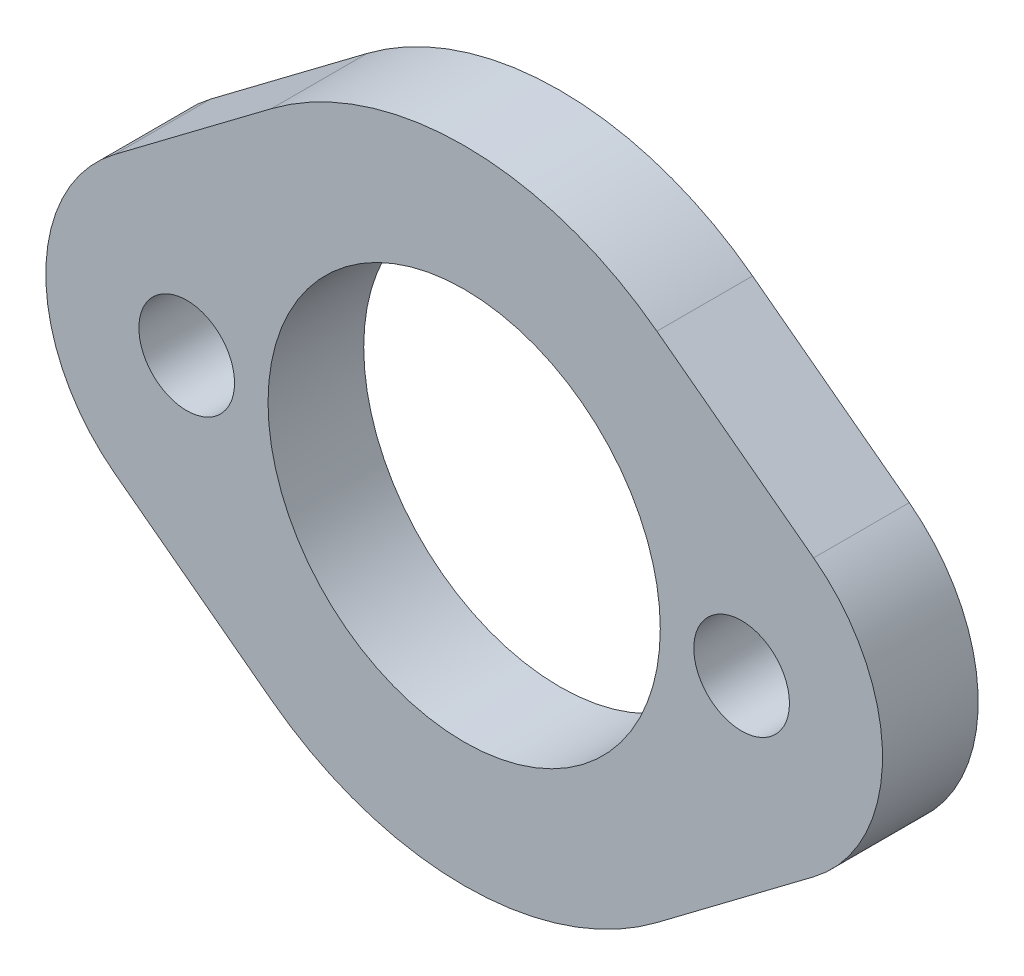
ISO-10303-21;
HEADER;
FILE_DESCRIPTION(('STEP AP214'),'2;1');
FILE_NAME('part.step','',(''),(''),'','','');
FILE_SCHEMA(('AUTOMOTIVE_DESIGN { 1 0 10303 214 1 1 1 1 }'));
ENDSEC;
DATA;
#1=APPLICATION_CONTEXT('core data for automotive mechanical design processes');
#2=APPLICATION_PROTOCOL_DEFINITION('international standard','automotive_design',2000,#1);
#3=PRODUCT_CONTEXT('',#1,'mechanical');
#4=PRODUCT('Part','Part','',(#3));
#5=PRODUCT_RELATED_PRODUCT_CATEGORY('part','',(#4));
#6=PRODUCT_DEFINITION_FORMATION('','',#4);
#7=PRODUCT_DEFINITION_CONTEXT('part definition',#1,'design');
#8=PRODUCT_DEFINITION('design','',#6,#7);
#9=PRODUCT_DEFINITION_SHAPE('','',#8);
#10=(LENGTH_UNIT() NAMED_UNIT(*) SI_UNIT(.MILLI.,.METRE.));
#11=(NAMED_UNIT(*) PLANE_ANGLE_UNIT() SI_UNIT($,.RADIAN.));
#12=(NAMED_UNIT(*) SI_UNIT($,.STERADIAN.) SOLID_ANGLE_UNIT());
#13=UNCERTAINTY_MEASURE_WITH_UNIT(LENGTH_MEASURE(1.E-05),#10,'distance_accuracy_value','');
#14=(GEOMETRIC_REPRESENTATION_CONTEXT(3) GLOBAL_UNCERTAINTY_ASSIGNED_CONTEXT((#13)) GLOBAL_UNIT_ASSIGNED_CONTEXT((#10,
#11,#12)) REPRESENTATION_CONTEXT('',''));
#15=CARTESIAN_POINT('',(0.,0.,0.));
#16=DIRECTION('',(0.,0.,1.));
#17=DIRECTION('',(1.,0.,0.));
#18=AXIS2_PLACEMENT_3D('',#15,#16,#17);
#19=CARTESIAN_POINT('',(-12.8297842923434,0.,5.));
#20=DIRECTION('',(0.,0.,1.));
#21=DIRECTION('',(1.,0.,0.));
#22=AXIS2_PLACEMENT_3D('',#19,#20,#21);
#23=PLANE('',#22);
#24=CARTESIAN_POINT('',(-14.5,0.,5.));
#25=DIRECTION('',(0.,0.,1.));
#26=DIRECTION('',(1.,0.,0.));
#27=AXIS2_PLACEMENT_3D('',#24,#25,#26);
#28=CIRCLE('',#27,2.5);
#29=CARTESIAN_POINT('',(-12.,0.,5.));
#30=VERTEX_POINT('',#29);
#31=EDGE_CURVE('E193',#30,#30,#28,.T.);
#32=ORIENTED_EDGE('',*,*,#31,.F.);
#33=EDGE_LOOP('',(#32));
#34=FACE_BOUND('',#33,.T.);
#35=CARTESIAN_POINT('',(-12.8297842923434,0.,5.));
#36=DIRECTION('',(0.,0.,1.));
#37=DIRECTION('',(1.,0.,0.));
#38=AXIS2_PLACEMENT_3D('',#35,#36,#37);
#39=CIRCLE('',#38,9.03409373618479);
#40=CARTESIAN_POINT('',(-18.2629403656315,7.21773265766097,5.));
#41=VERTEX_POINT('',#40);
#42=CARTESIAN_POINT('',(-18.2629403656315,-7.21773265766097,5.));
#43=VERTEX_POINT('',#42);
#44=EDGE_CURVE('E156',#41,#43,#39,.T.);
#45=ORIENTED_EDGE('',*,*,#44,.T.);
#46=DIRECTION('',(0.798943742276147,-0.601405767080584,0.));
#47=VECTOR('',#46,1.);
#48=CARTESIAN_POINT('',(-18.2629403656315,-7.21773265766097,5.));
#49=LINE('',#48,#47);
#50=CARTESIAN_POINT('',(-10.0735465985998,-13.3823076831255,5.));
#51=VERTEX_POINT('',#50);
#52=EDGE_CURVE('E104',#43,#51,#49,.T.);
#53=ORIENTED_EDGE('',*,*,#52,.T.);
#54=CARTESIAN_POINT('',(0.,0.,5.));
#55=DIRECTION('',(0.,0.,1.));
#56=DIRECTION('',(1.,0.,0.));
#57=AXIS2_PLACEMENT_3D('',#54,#55,#56);
#58=CIRCLE('',#57,16.75);
#59=CARTESIAN_POINT('',(10.0735465985998,-13.3823076831255,5.));
#60=VERTEX_POINT('',#59);
#61=EDGE_CURVE('E171',#51,#60,#58,.T.);
#62=ORIENTED_EDGE('',*,*,#61,.T.);
#63=DIRECTION('',(0.798943742276147,0.601405767080584,0.));
#64=VECTOR('',#63,1.);
#65=CARTESIAN_POINT('',(10.0735465985998,-13.3823076831255,5.));
#66=LINE('',#65,#64);
#67=CARTESIAN_POINT('',(18.2629403656315,-7.21773265766097,5.));
#68=VERTEX_POINT('',#67);
#69=EDGE_CURVE('E184',#60,#68,#66,.T.);
#70=ORIENTED_EDGE('',*,*,#69,.T.);
#71=CARTESIAN_POINT('',(12.8297842923434,0.,5.));
#72=DIRECTION('',(0.,0.,1.));
#73=DIRECTION('',(1.,0.,0.));
#74=AXIS2_PLACEMENT_3D('',#71,#72,#73);
#75=CIRCLE('',#74,9.03409373618479);
#76=CARTESIAN_POINT('',(18.2629403656315,7.21773265766097,5.));
#77=VERTEX_POINT('',#76);
#78=EDGE_CURVE('E123',#68,#77,#75,.T.);
#79=ORIENTED_EDGE('',*,*,#78,.T.);
#80=DIRECTION('',(-0.798943742276147,0.601405767080584,0.));
#81=VECTOR('',#80,1.);
#82=CARTESIAN_POINT('',(18.2629403656315,7.21773265766097,5.));
#83=LINE('',#82,#81);
#84=CARTESIAN_POINT('',(10.0735465985998,13.3823076831255,5.));
#85=VERTEX_POINT('',#84);
#86=EDGE_CURVE('E117',#77,#85,#83,.T.);
#87=ORIENTED_EDGE('',*,*,#86,.T.);
#88=CARTESIAN_POINT('',(0.,0.,5.));
#89=DIRECTION('',(0.,0.,1.));
#90=DIRECTION('',(1.,0.,0.));
#91=AXIS2_PLACEMENT_3D('',#88,#89,#90);
#92=CIRCLE('',#91,16.75);
#93=CARTESIAN_POINT('',(-10.0735465985998,13.3823076831255,5.));
#94=VERTEX_POINT('',#93);
#95=EDGE_CURVE('E121',#85,#94,#92,.T.);
#96=ORIENTED_EDGE('',*,*,#95,.T.);
#97=DIRECTION('',(-0.798943742276147,-0.601405767080584,0.));
#98=VECTOR('',#97,1.);
#99=CARTESIAN_POINT('',(-10.0735465985998,13.3823076831255,5.));
#100=LINE('',#99,#98);
#101=EDGE_CURVE('E61',#94,#41,#100,.T.);
#102=ORIENTED_EDGE('',*,*,#101,.T.);
#103=EDGE_LOOP('',(#45,#53,#62,#70,#79,#87,#96,#102));
#104=FACE_BOUND('',#103,.T.);
#105=CARTESIAN_POINT('',(14.5,0.,5.));
#106=DIRECTION('',(0.,0.,1.));
#107=DIRECTION('',(1.,0.,0.));
#108=AXIS2_PLACEMENT_3D('',#105,#106,#107);
#109=CIRCLE('',#108,2.5);
#110=CARTESIAN_POINT('',(17.,0.,5.));
#111=VERTEX_POINT('',#110);
#112=EDGE_CURVE('E145',#111,#111,#109,.T.);
#113=ORIENTED_EDGE('',*,*,#112,.F.);
#114=EDGE_LOOP('',(#113));
#115=FACE_BOUND('',#114,.T.);
#116=CARTESIAN_POINT('',(0.,0.,5.));
#117=DIRECTION('',(0.,0.,1.));
#118=DIRECTION('',(1.,0.,0.));
#119=AXIS2_PLACEMENT_3D('',#116,#117,#118);
#120=CIRCLE('',#119,10.25);
#121=CARTESIAN_POINT('',(10.25,0.,5.));
#122=VERTEX_POINT('',#121);
#123=EDGE_CURVE('E199',#122,#122,#120,.T.);
#124=ORIENTED_EDGE('',*,*,#123,.F.);
#125=EDGE_LOOP('',(#124));
#126=FACE_BOUND('',#125,.T.);
#127=ADVANCED_FACE('F44',(#34,#104,#115,#126),#23,.T.);
#128=CARTESIAN_POINT('',(-12.8297842923434,0.,0.));
#129=DIRECTION('',(0.,0.,1.));
#130=DIRECTION('',(1.,0.,0.));
#131=AXIS2_PLACEMENT_3D('',#128,#129,#130);
#132=PLANE('',#131);
#133=CARTESIAN_POINT('',(-12.8297842923434,0.,0.));
#134=DIRECTION('',(0.,0.,1.));
#135=DIRECTION('',(1.,0.,0.));
#136=AXIS2_PLACEMENT_3D('',#133,#134,#135);
#137=CIRCLE('',#136,9.03409373618479);
#138=CARTESIAN_POINT('',(-18.2629403656315,7.21773265766097,0.));
#139=VERTEX_POINT('',#138);
#140=CARTESIAN_POINT('',(-18.2629403656315,-7.21773265766097,0.));
#141=VERTEX_POINT('',#140);
#142=EDGE_CURVE('E141',#139,#141,#137,.T.);
#143=ORIENTED_EDGE('',*,*,#142,.F.);
#144=DIRECTION('',(-0.798943742276147,-0.601405767080584,0.));
#145=VECTOR('',#144,1.);
#146=CARTESIAN_POINT('',(-10.0735465985998,13.3823076831255,0.));
#147=LINE('',#146,#145);
#148=CARTESIAN_POINT('',(-10.0735465985998,13.3823076831255,0.));
#149=VERTEX_POINT('',#148);
#150=EDGE_CURVE('E96',#149,#139,#147,.T.);
#151=ORIENTED_EDGE('',*,*,#150,.F.);
#152=CARTESIAN_POINT('',(0.,0.,0.));
#153=DIRECTION('',(0.,0.,1.));
#154=DIRECTION('',(1.,0.,0.));
#155=AXIS2_PLACEMENT_3D('',#152,#153,#154);
#156=CIRCLE('',#155,16.75);
#157=CARTESIAN_POINT('',(10.0735465985998,13.3823076831255,0.));
#158=VERTEX_POINT('',#157);
#159=EDGE_CURVE('E90',#158,#149,#156,.T.);
#160=ORIENTED_EDGE('',*,*,#159,.F.);
#161=DIRECTION('',(-0.798943742276147,0.601405767080584,0.));
#162=VECTOR('',#161,1.);
#163=CARTESIAN_POINT('',(18.2629403656315,7.21773265766097,0.));
#164=LINE('',#163,#162);
#165=CARTESIAN_POINT('',(18.2629403656315,7.21773265766097,0.));
#166=VERTEX_POINT('',#165);
#167=EDGE_CURVE('E131',#166,#158,#164,.T.);
#168=ORIENTED_EDGE('',*,*,#167,.F.);
#169=CARTESIAN_POINT('',(12.8297842923434,0.,0.));
#170=DIRECTION('',(0.,0.,1.));
#171=DIRECTION('',(1.,0.,0.));
#172=AXIS2_PLACEMENT_3D('',#169,#170,#171);
#173=CIRCLE('',#172,9.03409373618479);
#174=CARTESIAN_POINT('',(18.2629403656315,-7.21773265766097,0.));
#175=VERTEX_POINT('',#174);
#176=EDGE_CURVE('E151',#175,#166,#173,.T.);
#177=ORIENTED_EDGE('',*,*,#176,.F.);
#178=DIRECTION('',(0.798943742276147,0.601405767080584,0.));
#179=VECTOR('',#178,1.);
#180=CARTESIAN_POINT('',(10.0735465985998,-13.3823076831255,0.));
#181=LINE('',#180,#179);
#182=CARTESIAN_POINT('',(10.0735465985998,-13.3823076831255,0.));
#183=VERTEX_POINT('',#182);
#184=EDGE_CURVE('E149',#183,#175,#181,.T.);
#185=ORIENTED_EDGE('',*,*,#184,.F.);
#186=CARTESIAN_POINT('',(0.,0.,0.));
#187=DIRECTION('',(0.,0.,1.));
#188=DIRECTION('',(1.,0.,0.));
#189=AXIS2_PLACEMENT_3D('',#186,#187,#188);
#190=CIRCLE('',#189,16.75);
#191=CARTESIAN_POINT('',(-10.0735465985998,-13.3823076831255,0.));
#192=VERTEX_POINT('',#191);
#193=EDGE_CURVE('E147',#192,#183,#190,.T.);
#194=ORIENTED_EDGE('',*,*,#193,.F.);
#195=DIRECTION('',(0.798943742276147,-0.601405767080584,0.));
#196=VECTOR('',#195,1.);
#197=CARTESIAN_POINT('',(-18.2629403656315,-7.21773265766097,0.));
#198=LINE('',#197,#196);
#199=EDGE_CURVE('E144',#141,#192,#198,.T.);
#200=ORIENTED_EDGE('',*,*,#199,.F.);
#201=EDGE_LOOP('',(#143,#151,#160,#168,#177,#185,#194,#200));
#202=FACE_BOUND('',#201,.T.);
#203=CARTESIAN_POINT('',(14.5,0.,0.));
#204=DIRECTION('',(0.,0.,1.));
#205=DIRECTION('',(1.,0.,0.));
#206=AXIS2_PLACEMENT_3D('',#203,#204,#205);
#207=CIRCLE('',#206,2.5);
#208=CARTESIAN_POINT('',(17.,0.,0.));
#209=VERTEX_POINT('',#208);
#210=EDGE_CURVE('E190',#209,#209,#207,.T.);
#211=ORIENTED_EDGE('',*,*,#210,.T.);
#212=EDGE_LOOP('',(#211));
#213=FACE_BOUND('',#212,.T.);
#214=CARTESIAN_POINT('',(-14.5,0.,0.));
#215=DIRECTION('',(0.,0.,1.));
#216=DIRECTION('',(1.,0.,0.));
#217=AXIS2_PLACEMENT_3D('',#214,#215,#216);
#218=CIRCLE('',#217,2.5);
#219=CARTESIAN_POINT('',(-12.,0.,0.));
#220=VERTEX_POINT('',#219);
#221=EDGE_CURVE('E196',#220,#220,#218,.T.);
#222=ORIENTED_EDGE('',*,*,#221,.T.);
#223=EDGE_LOOP('',(#222));
#224=FACE_BOUND('',#223,.T.);
#225=CARTESIAN_POINT('',(0.,0.,0.));
#226=DIRECTION('',(0.,0.,1.));
#227=DIRECTION('',(1.,0.,0.));
#228=AXIS2_PLACEMENT_3D('',#225,#226,#227);
#229=CIRCLE('',#228,10.25);
#230=CARTESIAN_POINT('',(10.25,0.,0.));
#231=VERTEX_POINT('',#230);
#232=EDGE_CURVE('E202',#231,#231,#229,.T.);
#233=ORIENTED_EDGE('',*,*,#232,.T.);
#234=EDGE_LOOP('',(#233));
#235=FACE_BOUND('',#234,.T.);
#236=ADVANCED_FACE('F175',(#202,#213,#224,#235),#132,.F.);
#237=CARTESIAN_POINT('',(-12.8297842923434,0.,5.));
#238=DIRECTION('',(0.,0.,-1.));
#239=DIRECTION('',(-1.,0.,0.));
#240=AXIS2_PLACEMENT_3D('',#237,#238,#239);
#241=CYLINDRICAL_SURFACE('',#240,9.03409373618479);
#242=ORIENTED_EDGE('',*,*,#142,.T.);
#243=DIRECTION('',(0.,0.,-1.));
#244=VECTOR('',#243,1.);
#245=CARTESIAN_POINT('',(-18.2629403656315,-7.21773265766097,5.));
#246=LINE('',#245,#244);
#247=EDGE_CURVE('E13',#43,#141,#246,.T.);
#248=ORIENTED_EDGE('',*,*,#247,.F.);
#249=ORIENTED_EDGE('',*,*,#44,.F.);
#250=DIRECTION('',(0.,0.,-1.));
#251=VECTOR('',#250,1.);
#252=CARTESIAN_POINT('',(-18.2629403656315,7.21773265766097,5.));
#253=LINE('',#252,#251);
#254=EDGE_CURVE('E137',#41,#139,#253,.T.);
#255=ORIENTED_EDGE('',*,*,#254,.T.);
#256=EDGE_LOOP('',(#242,#248,#249,#255));
#257=FACE_BOUND('',#256,.T.);
#258=ADVANCED_FACE('F46',(#257),#241,.T.);
#259=CARTESIAN_POINT('',(-18.2629403656315,-7.21773265766097,5.));
#260=DIRECTION('',(0.601405767080584,0.798943742276147,0.));
#261=DIRECTION('',(-0.798943742276147,0.601405767080584,0.));
#262=AXIS2_PLACEMENT_3D('',#259,#260,#261);
#263=PLANE('',#262);
#264=ORIENTED_EDGE('',*,*,#199,.T.);
#265=DIRECTION('',(0.,0.,-1.));
#266=VECTOR('',#265,1.);
#267=CARTESIAN_POINT('',(-10.0735465985998,-13.3823076831255,5.));
#268=LINE('',#267,#266);
#269=EDGE_CURVE('E53',#51,#192,#268,.T.);
#270=ORIENTED_EDGE('',*,*,#269,.F.);
#271=ORIENTED_EDGE('',*,*,#52,.F.);
#272=ORIENTED_EDGE('',*,*,#247,.T.);
#273=EDGE_LOOP('',(#264,#270,#271,#272));
#274=FACE_BOUND('',#273,.T.);
#275=ADVANCED_FACE('F235',(#274),#263,.F.);
#276=CARTESIAN_POINT('',(0.,0.,5.));
#277=DIRECTION('',(0.,0.,-1.));
#278=DIRECTION('',(-1.,0.,0.));
#279=AXIS2_PLACEMENT_3D('',#276,#277,#278);
#280=CYLINDRICAL_SURFACE('',#279,16.75);
#281=ORIENTED_EDGE('',*,*,#193,.T.);
#282=DIRECTION('',(0.,0.,-1.));
#283=VECTOR('',#282,1.);
#284=CARTESIAN_POINT('',(10.0735465985998,-13.3823076831255,5.));
#285=LINE('',#284,#283);
#286=EDGE_CURVE('E163',#60,#183,#285,.T.);
#287=ORIENTED_EDGE('',*,*,#286,.F.);
#288=ORIENTED_EDGE('',*,*,#61,.F.);
#289=ORIENTED_EDGE('',*,*,#269,.T.);
#290=EDGE_LOOP('',(#281,#287,#288,#289));
#291=FACE_BOUND('',#290,.T.);
#292=ADVANCED_FACE('F169',(#291),#280,.T.);
#293=CARTESIAN_POINT('',(10.0735465985998,-13.3823076831255,5.));
#294=DIRECTION('',(-0.601405767080584,0.798943742276147,0.));
#295=DIRECTION('',(-0.798943742276147,-0.601405767080584,0.));
#296=AXIS2_PLACEMENT_3D('',#293,#294,#295);
#297=PLANE('',#296);
#298=ORIENTED_EDGE('',*,*,#184,.T.);
#299=DIRECTION('',(0.,0.,-1.));
#300=VECTOR('',#299,1.);
#301=CARTESIAN_POINT('',(18.2629403656315,-7.21773265766097,5.));
#302=LINE('',#301,#300);
#303=EDGE_CURVE('E160',#68,#175,#302,.T.);
#304=ORIENTED_EDGE('',*,*,#303,.F.);
#305=ORIENTED_EDGE('',*,*,#69,.F.);
#306=ORIENTED_EDGE('',*,*,#286,.T.);
#307=EDGE_LOOP('',(#298,#304,#305,#306));
#308=FACE_BOUND('',#307,.T.);
#309=ADVANCED_FACE('F180',(#308),#297,.F.);
#310=CARTESIAN_POINT('',(12.8297842923434,0.,5.));
#311=DIRECTION('',(0.,0.,-1.));
#312=DIRECTION('',(-1.,0.,0.));
#313=AXIS2_PLACEMENT_3D('',#310,#311,#312);
#314=CYLINDRICAL_SURFACE('',#313,9.03409373618479);
#315=ORIENTED_EDGE('',*,*,#176,.T.);
#316=DIRECTION('',(0.,0.,-1.));
#317=VECTOR('',#316,1.);
#318=CARTESIAN_POINT('',(18.2629403656315,7.21773265766097,5.));
#319=LINE('',#318,#317);
#320=EDGE_CURVE('E132',#77,#166,#319,.T.);
#321=ORIENTED_EDGE('',*,*,#320,.F.);
#322=ORIENTED_EDGE('',*,*,#78,.F.);
#323=ORIENTED_EDGE('',*,*,#303,.T.);
#324=EDGE_LOOP('',(#315,#321,#322,#323));
#325=FACE_BOUND('',#324,.T.);
#326=ADVANCED_FACE('F183',(#325),#314,.T.);
#327=CARTESIAN_POINT('',(18.2629403656315,7.21773265766097,5.));
#328=DIRECTION('',(-0.601405767080584,-0.798943742276147,0.));
#329=DIRECTION('',(0.798943742276147,-0.601405767080584,0.));
#330=AXIS2_PLACEMENT_3D('',#327,#328,#329);
#331=PLANE('',#330);
#332=ORIENTED_EDGE('',*,*,#167,.T.);
#333=DIRECTION('',(0.,0.,-1.));
#334=VECTOR('',#333,1.);
#335=CARTESIAN_POINT('',(10.0735465985998,13.3823076831255,5.));
#336=LINE('',#335,#334);
#337=EDGE_CURVE('E128',#85,#158,#336,.T.);
#338=ORIENTED_EDGE('',*,*,#337,.F.);
#339=ORIENTED_EDGE('',*,*,#86,.F.);
#340=ORIENTED_EDGE('',*,*,#320,.T.);
#341=EDGE_LOOP('',(#332,#338,#339,#340));
#342=FACE_BOUND('',#341,.T.);
#343=ADVANCED_FACE('F129',(#342),#331,.F.);
#344=CARTESIAN_POINT('',(0.,0.,5.));
#345=DIRECTION('',(0.,0.,-1.));
#346=DIRECTION('',(-1.,0.,0.));
#347=AXIS2_PLACEMENT_3D('',#344,#345,#346);
#348=CYLINDRICAL_SURFACE('',#347,16.75);
#349=ORIENTED_EDGE('',*,*,#159,.T.);
#350=DIRECTION('',(0.,0.,-1.));
#351=VECTOR('',#350,1.);
#352=CARTESIAN_POINT('',(-10.0735465985998,13.3823076831255,5.));
#353=LINE('',#352,#351);
#354=EDGE_CURVE('E133',#94,#149,#353,.T.);
#355=ORIENTED_EDGE('',*,*,#354,.F.);
#356=ORIENTED_EDGE('',*,*,#95,.F.);
#357=ORIENTED_EDGE('',*,*,#337,.T.);
#358=EDGE_LOOP('',(#349,#355,#356,#357));
#359=FACE_BOUND('',#358,.T.);
#360=ADVANCED_FACE('F135',(#359),#348,.T.);
#361=CARTESIAN_POINT('',(-10.0735465985998,13.3823076831255,5.));
#362=DIRECTION('',(0.601405767080584,-0.798943742276147,0.));
#363=DIRECTION('',(0.798943742276147,0.601405767080584,0.));
#364=AXIS2_PLACEMENT_3D('',#361,#362,#363);
#365=PLANE('',#364);
#366=ORIENTED_EDGE('',*,*,#150,.T.);
#367=ORIENTED_EDGE('',*,*,#254,.F.);
#368=ORIENTED_EDGE('',*,*,#101,.F.);
#369=ORIENTED_EDGE('',*,*,#354,.T.);
#370=EDGE_LOOP('',(#366,#367,#368,#369));
#371=FACE_BOUND('',#370,.T.);
#372=ADVANCED_FACE('F223',(#371),#365,.F.);
#373=CARTESIAN_POINT('',(14.5,0.,5.));
#374=DIRECTION('',(0.,0.,-1.));
#375=DIRECTION('',(-1.,0.,0.));
#376=AXIS2_PLACEMENT_3D('',#373,#374,#375);
#377=CYLINDRICAL_SURFACE('',#376,2.5);
#378=ORIENTED_EDGE('',*,*,#112,.T.);
#379=EDGE_LOOP('',(#378));
#380=FACE_BOUND('',#379,.T.);
#381=ORIENTED_EDGE('',*,*,#210,.F.);
#382=EDGE_LOOP('',(#381));
#383=FACE_BOUND('',#382,.T.);
#384=ADVANCED_FACE('F220',(#380,#383),#377,.F.);
#385=CARTESIAN_POINT('',(-14.5,0.,5.));
#386=DIRECTION('',(0.,0.,-1.));
#387=DIRECTION('',(-1.,0.,0.));
#388=AXIS2_PLACEMENT_3D('',#385,#386,#387);
#389=CYLINDRICAL_SURFACE('',#388,2.5);
#390=ORIENTED_EDGE('',*,*,#31,.T.);
#391=EDGE_LOOP('',(#390));
#392=FACE_BOUND('',#391,.T.);
#393=ORIENTED_EDGE('',*,*,#221,.F.);
#394=EDGE_LOOP('',(#393));
#395=FACE_BOUND('',#394,.T.);
#396=ADVANCED_FACE('F299',(#392,#395),#389,.F.);
#397=CARTESIAN_POINT('',(0.,0.,5.));
#398=DIRECTION('',(0.,0.,-1.));
#399=DIRECTION('',(-1.,0.,0.));
#400=AXIS2_PLACEMENT_3D('',#397,#398,#399);
#401=CYLINDRICAL_SURFACE('',#400,10.25);
#402=ORIENTED_EDGE('',*,*,#123,.T.);
#403=EDGE_LOOP('',(#402));
#404=FACE_BOUND('',#403,.T.);
#405=ORIENTED_EDGE('',*,*,#232,.F.);
#406=EDGE_LOOP('',(#405));
#407=FACE_BOUND('',#406,.T.);
#408=ADVANCED_FACE('F208',(#404,#407),#401,.F.);
#409=CLOSED_SHELL('',(#127,#236,#258,#275,#292,#309,#326,#343,#360,#372,#384,#396,#408));
#410=MANIFOLD_SOLID_BREP('B2',#409);
#411=ADVANCED_BREP_SHAPE_REPRESENTATION('',(#18,#410),#14);
#412=SHAPE_DEFINITION_REPRESENTATION(#9,#411);
ENDSEC;
END-ISO-10303-21;
